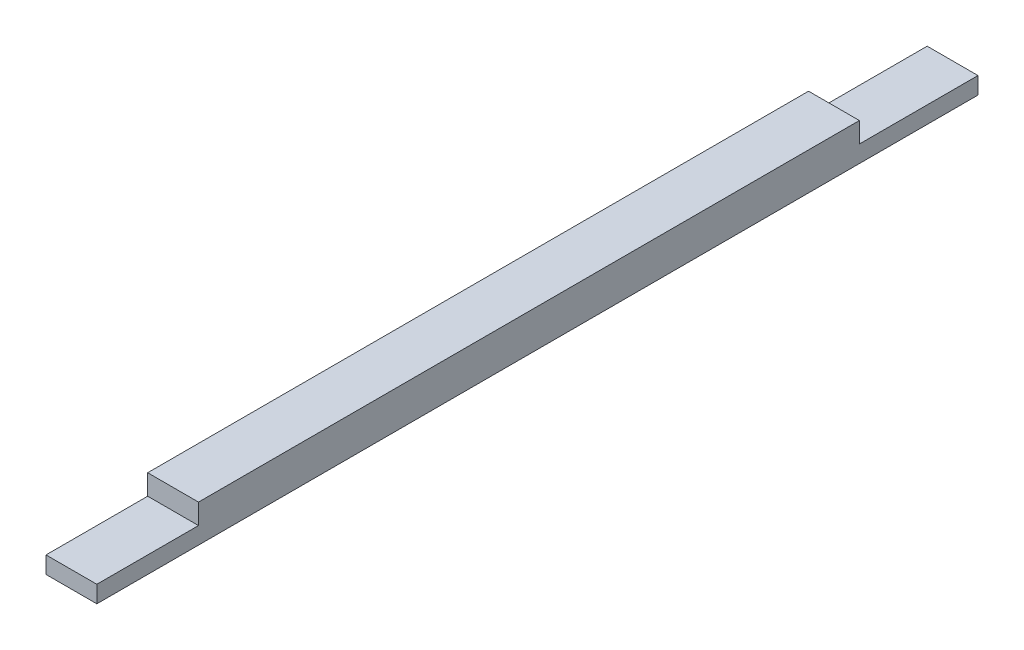
ISO-10303-21;
HEADER;
FILE_DESCRIPTION(('STEP AP214'),'2;1');
FILE_NAME('part.step','',(''),(''),'','','');
FILE_SCHEMA(('AUTOMOTIVE_DESIGN { 1 0 10303 214 1 1 1 1 }'));
ENDSEC;
DATA;
#1=APPLICATION_CONTEXT('core data for automotive mechanical design processes');
#2=APPLICATION_PROTOCOL_DEFINITION('international standard','automotive_design',2000,#1);
#3=PRODUCT_CONTEXT('',#1,'mechanical');
#4=PRODUCT('Part','Part','',(#3));
#5=PRODUCT_RELATED_PRODUCT_CATEGORY('part','',(#4));
#6=PRODUCT_DEFINITION_FORMATION('','',#4);
#7=PRODUCT_DEFINITION_CONTEXT('part definition',#1,'design');
#8=PRODUCT_DEFINITION('design','',#6,#7);
#9=PRODUCT_DEFINITION_SHAPE('','',#8);
#10=(LENGTH_UNIT() NAMED_UNIT(*) SI_UNIT(.MILLI.,.METRE.));
#11=(NAMED_UNIT(*) PLANE_ANGLE_UNIT() SI_UNIT($,.RADIAN.));
#12=(NAMED_UNIT(*) SI_UNIT($,.STERADIAN.) SOLID_ANGLE_UNIT());
#13=UNCERTAINTY_MEASURE_WITH_UNIT(LENGTH_MEASURE(1.E-05),#10,'distance_accuracy_value','');
#14=(GEOMETRIC_REPRESENTATION_CONTEXT(3) GLOBAL_UNCERTAINTY_ASSIGNED_CONTEXT((#13)) GLOBAL_UNIT_ASSIGNED_CONTEXT((#10,
#11,#12)) REPRESENTATION_CONTEXT('',''));
#15=CARTESIAN_POINT('',(0.,0.,0.));
#16=DIRECTION('',(0.,0.,1.));
#17=DIRECTION('',(1.,0.,0.));
#18=AXIS2_PLACEMENT_3D('',#15,#16,#17);
#19=CARTESIAN_POINT('',(0.,0.,52.));
#20=DIRECTION('',(0.,-1.,0.));
#21=DIRECTION('',(0.,0.,-1.));
#22=AXIS2_PLACEMENT_3D('',#19,#20,#21);
#23=PLANE('',#22);
#24=DIRECTION('',(-1.,0.,0.));
#25=VECTOR('',#24,1.);
#26=CARTESIAN_POINT('',(0.,0.,7.));
#27=LINE('',#26,#25);
#28=CARTESIAN_POINT('',(3.,0.,7.00000000000001));
#29=VERTEX_POINT('',#28);
#30=CARTESIAN_POINT('',(0.,0.,7.00000000000001));
#31=VERTEX_POINT('',#30);
#32=EDGE_CURVE('E49',#29,#31,#27,.T.);
#33=ORIENTED_EDGE('',*,*,#32,.F.);
#34=DIRECTION('',(0.,0.,-1.));
#35=VECTOR('',#34,1.);
#36=CARTESIAN_POINT('',(3.,0.,52.));
#37=LINE('',#36,#35);
#38=CARTESIAN_POINT('',(3.,0.,0.));
#39=VERTEX_POINT('',#38);
#40=EDGE_CURVE('E147',#29,#39,#37,.T.);
#41=ORIENTED_EDGE('',*,*,#40,.T.);
#42=DIRECTION('',(-1.,0.,0.));
#43=VECTOR('',#42,1.);
#44=CARTESIAN_POINT('',(0.,0.,0.));
#45=LINE('',#44,#43);
#46=CARTESIAN_POINT('',(0.,0.,0.));
#47=VERTEX_POINT('',#46);
#48=EDGE_CURVE('E135',#39,#47,#45,.T.);
#49=ORIENTED_EDGE('',*,*,#48,.T.);
#50=DIRECTION('',(0.,0.,-1.));
#51=VECTOR('',#50,1.);
#52=CARTESIAN_POINT('',(0.,0.,52.));
#53=LINE('',#52,#51);
#54=EDGE_CURVE('E54',#31,#47,#53,.T.);
#55=ORIENTED_EDGE('',*,*,#54,.F.);
#56=EDGE_LOOP('',(#33,#41,#49,#55));
#57=FACE_BOUND('',#56,.T.);
#58=ADVANCED_FACE('F34',(#57),#23,.F.);
#59=DIRECTION('',(1.,0.,0.));
#60=VECTOR('',#59,1.);
#61=CARTESIAN_POINT('',(0.,0.,46.));
#62=LINE('',#61,#60);
#63=CARTESIAN_POINT('',(0.,0.,46.));
#64=VERTEX_POINT('',#63);
#65=CARTESIAN_POINT('',(3.,0.,46.));
#66=VERTEX_POINT('',#65);
#67=EDGE_CURVE('E169',#64,#66,#62,.T.);
#68=ORIENTED_EDGE('',*,*,#67,.F.);
#69=CARTESIAN_POINT('',(0.,0.,52.));
#70=VERTEX_POINT('',#69);
#71=EDGE_CURVE('E122',#70,#64,#53,.T.);
#72=ORIENTED_EDGE('',*,*,#71,.F.);
#73=DIRECTION('',(-1.,0.,0.));
#74=VECTOR('',#73,1.);
#75=CARTESIAN_POINT('',(0.,0.,52.));
#76=LINE('',#75,#74);
#77=CARTESIAN_POINT('',(3.,0.,52.));
#78=VERTEX_POINT('',#77);
#79=EDGE_CURVE('E139',#78,#70,#76,.T.);
#80=ORIENTED_EDGE('',*,*,#79,.F.);
#81=EDGE_CURVE('E148',#78,#66,#37,.T.);
#82=ORIENTED_EDGE('',*,*,#81,.T.);
#83=EDGE_LOOP('',(#68,#72,#80,#82));
#84=FACE_BOUND('',#83,.T.);
#85=ADVANCED_FACE('F174',(#84),#23,.F.);
#86=CARTESIAN_POINT('',(0.,0.,52.));
#87=DIRECTION('',(1.,0.,0.));
#88=DIRECTION('',(0.,1.,0.));
#89=AXIS2_PLACEMENT_3D('',#86,#87,#88);
#90=PLANE('',#89);
#91=DIRECTION('',(0.,-1.,0.));
#92=VECTOR('',#91,1.);
#93=CARTESIAN_POINT('',(0.,0.,0.));
#94=LINE('',#93,#92);
#95=CARTESIAN_POINT('',(0.,-1.,0.));
#96=VERTEX_POINT('',#95);
#97=EDGE_CURVE('E123',#47,#96,#94,.T.);
#98=ORIENTED_EDGE('',*,*,#97,.T.);
#99=DIRECTION('',(0.,0.,-1.));
#100=VECTOR('',#99,1.);
#101=CARTESIAN_POINT('',(0.,-1.,52.));
#102=LINE('',#101,#100);
#103=CARTESIAN_POINT('',(0.,-1.,52.));
#104=VERTEX_POINT('',#103);
#105=EDGE_CURVE('E11',#104,#96,#102,.T.);
#106=ORIENTED_EDGE('',*,*,#105,.F.);
#107=DIRECTION('',(0.,-1.,0.));
#108=VECTOR('',#107,1.);
#109=CARTESIAN_POINT('',(0.,0.,52.));
#110=LINE('',#109,#108);
#111=EDGE_CURVE('E131',#70,#104,#110,.T.);
#112=ORIENTED_EDGE('',*,*,#111,.F.);
#113=ORIENTED_EDGE('',*,*,#71,.T.);
#114=DIRECTION('',(0.,-1.,0.));
#115=VECTOR('',#114,1.);
#116=CARTESIAN_POINT('',(0.,1.2,46.));
#117=LINE('',#116,#115);
#118=CARTESIAN_POINT('',(0.,1.2,46.));
#119=VERTEX_POINT('',#118);
#120=EDGE_CURVE('E102',#119,#64,#117,.T.);
#121=ORIENTED_EDGE('',*,*,#120,.F.);
#122=DIRECTION('',(0.,0.,1.));
#123=VECTOR('',#122,1.);
#124=CARTESIAN_POINT('',(0.,1.2,7.));
#125=LINE('',#124,#123);
#126=CARTESIAN_POINT('',(0.,1.2,7.));
#127=VERTEX_POINT('',#126);
#128=EDGE_CURVE('E108',#127,#119,#125,.T.);
#129=ORIENTED_EDGE('',*,*,#128,.F.);
#130=DIRECTION('',(0.,-1.,0.));
#131=VECTOR('',#130,1.);
#132=CARTESIAN_POINT('',(0.,1.2,7.));
#133=LINE('',#132,#131);
#134=EDGE_CURVE('E165',#127,#31,#133,.T.);
#135=ORIENTED_EDGE('',*,*,#134,.T.);
#136=ORIENTED_EDGE('',*,*,#54,.T.);
#137=EDGE_LOOP('',(#98,#106,#112,#113,#121,#129,#135,#136));
#138=FACE_BOUND('',#137,.T.);
#139=ADVANCED_FACE('F36',(#138),#90,.F.);
#140=CARTESIAN_POINT('',(0.,-1.,52.));
#141=DIRECTION('',(0.,1.,0.));
#142=DIRECTION('',(0.,0.,1.));
#143=AXIS2_PLACEMENT_3D('',#140,#141,#142);
#144=PLANE('',#143);
#145=DIRECTION('',(1.,0.,0.));
#146=VECTOR('',#145,1.);
#147=CARTESIAN_POINT('',(0.,-1.,0.));
#148=LINE('',#147,#146);
#149=CARTESIAN_POINT('',(3.,-1.,0.));
#150=VERTEX_POINT('',#149);
#151=EDGE_CURVE('E125',#96,#150,#148,.T.);
#152=ORIENTED_EDGE('',*,*,#151,.T.);
#153=DIRECTION('',(0.,0.,-1.));
#154=VECTOR('',#153,1.);
#155=CARTESIAN_POINT('',(3.,-1.,52.));
#156=LINE('',#155,#154);
#157=CARTESIAN_POINT('',(3.,-1.,52.));
#158=VERTEX_POINT('',#157);
#159=EDGE_CURVE('E42',#158,#150,#156,.T.);
#160=ORIENTED_EDGE('',*,*,#159,.F.);
#161=DIRECTION('',(1.,0.,0.));
#162=VECTOR('',#161,1.);
#163=CARTESIAN_POINT('',(0.,-1.,52.));
#164=LINE('',#163,#162);
#165=EDGE_CURVE('E134',#104,#158,#164,.T.);
#166=ORIENTED_EDGE('',*,*,#165,.F.);
#167=ORIENTED_EDGE('',*,*,#105,.T.);
#168=EDGE_LOOP('',(#152,#160,#166,#167));
#169=FACE_BOUND('',#168,.T.);
#170=ADVANCED_FACE('F178',(#169),#144,.F.);
#171=CARTESIAN_POINT('',(3.,0.,52.));
#172=DIRECTION('',(-1.,0.,0.));
#173=DIRECTION('',(0.,0.,1.));
#174=AXIS2_PLACEMENT_3D('',#171,#172,#173);
#175=PLANE('',#174);
#176=DIRECTION('',(0.,1.,0.));
#177=VECTOR('',#176,1.);
#178=CARTESIAN_POINT('',(3.,0.,0.));
#179=LINE('',#178,#177);
#180=EDGE_CURVE('E142',#150,#39,#179,.T.);
#181=ORIENTED_EDGE('',*,*,#180,.T.);
#182=ORIENTED_EDGE('',*,*,#40,.F.);
#183=DIRECTION('',(0.,-1.,0.));
#184=VECTOR('',#183,1.);
#185=CARTESIAN_POINT('',(3.,1.2,7.));
#186=LINE('',#185,#184);
#187=CARTESIAN_POINT('',(3.,1.2,7.));
#188=VERTEX_POINT('',#187);
#189=EDGE_CURVE('E127',#188,#29,#186,.T.);
#190=ORIENTED_EDGE('',*,*,#189,.F.);
#191=DIRECTION('',(0.,0.,-1.));
#192=VECTOR('',#191,1.);
#193=CARTESIAN_POINT('',(3.,1.2,7.));
#194=LINE('',#193,#192);
#195=CARTESIAN_POINT('',(3.,1.2,46.));
#196=VERTEX_POINT('',#195);
#197=EDGE_CURVE('E107',#196,#188,#194,.T.);
#198=ORIENTED_EDGE('',*,*,#197,.F.);
#199=DIRECTION('',(0.,-1.,0.));
#200=VECTOR('',#199,1.);
#201=CARTESIAN_POINT('',(3.,1.2,46.));
#202=LINE('',#201,#200);
#203=EDGE_CURVE('E104',#196,#66,#202,.T.);
#204=ORIENTED_EDGE('',*,*,#203,.T.);
#205=ORIENTED_EDGE('',*,*,#81,.F.);
#206=DIRECTION('',(0.,1.,0.));
#207=VECTOR('',#206,1.);
#208=CARTESIAN_POINT('',(3.,0.,52.));
#209=LINE('',#208,#207);
#210=EDGE_CURVE('E137',#158,#78,#209,.T.);
#211=ORIENTED_EDGE('',*,*,#210,.F.);
#212=ORIENTED_EDGE('',*,*,#159,.T.);
#213=EDGE_LOOP('',(#181,#182,#190,#198,#204,#205,#211,#212));
#214=FACE_BOUND('',#213,.T.);
#215=ADVANCED_FACE('F154',(#214),#175,.F.);
#216=CARTESIAN_POINT('',(0.,0.,52.));
#217=DIRECTION('',(0.,0.,1.));
#218=DIRECTION('',(1.,0.,0.));
#219=AXIS2_PLACEMENT_3D('',#216,#217,#218);
#220=PLANE('',#219);
#221=ORIENTED_EDGE('',*,*,#111,.T.);
#222=ORIENTED_EDGE('',*,*,#165,.T.);
#223=ORIENTED_EDGE('',*,*,#210,.T.);
#224=ORIENTED_EDGE('',*,*,#79,.T.);
#225=EDGE_LOOP('',(#221,#222,#223,#224));
#226=FACE_BOUND('',#225,.T.);
#227=ADVANCED_FACE('F176',(#226),#220,.T.);
#228=CARTESIAN_POINT('',(0.,0.,0.));
#229=DIRECTION('',(0.,0.,1.));
#230=DIRECTION('',(1.,0.,0.));
#231=AXIS2_PLACEMENT_3D('',#228,#229,#230);
#232=PLANE('',#231);
#233=ORIENTED_EDGE('',*,*,#97,.F.);
#234=ORIENTED_EDGE('',*,*,#48,.F.);
#235=ORIENTED_EDGE('',*,*,#180,.F.);
#236=ORIENTED_EDGE('',*,*,#151,.F.);
#237=EDGE_LOOP('',(#233,#234,#235,#236));
#238=FACE_BOUND('',#237,.T.);
#239=ADVANCED_FACE('F160',(#238),#232,.F.);
#240=CARTESIAN_POINT('',(0.,1.2,46.));
#241=DIRECTION('',(0.,0.,-1.));
#242=DIRECTION('',(-1.,0.,0.));
#243=AXIS2_PLACEMENT_3D('',#240,#241,#242);
#244=PLANE('',#243);
#245=ORIENTED_EDGE('',*,*,#67,.T.);
#246=ORIENTED_EDGE('',*,*,#203,.F.);
#247=DIRECTION('',(1.,0.,0.));
#248=VECTOR('',#247,1.);
#249=CARTESIAN_POINT('',(0.,1.2,46.));
#250=LINE('',#249,#248);
#251=EDGE_CURVE('E97',#119,#196,#250,.T.);
#252=ORIENTED_EDGE('',*,*,#251,.F.);
#253=ORIENTED_EDGE('',*,*,#120,.T.);
#254=EDGE_LOOP('',(#245,#246,#252,#253));
#255=FACE_BOUND('',#254,.T.);
#256=ADVANCED_FACE('F100',(#255),#244,.F.);
#257=CARTESIAN_POINT('',(0.,1.2,7.));
#258=DIRECTION('',(0.,0.,1.));
#259=DIRECTION('',(1.,0.,0.));
#260=AXIS2_PLACEMENT_3D('',#257,#258,#259);
#261=PLANE('',#260);
#262=ORIENTED_EDGE('',*,*,#32,.T.);
#263=ORIENTED_EDGE('',*,*,#134,.F.);
#264=DIRECTION('',(-1.,0.,0.));
#265=VECTOR('',#264,1.);
#266=CARTESIAN_POINT('',(0.,1.2,7.));
#267=LINE('',#266,#265);
#268=EDGE_CURVE('E113',#188,#127,#267,.T.);
#269=ORIENTED_EDGE('',*,*,#268,.F.);
#270=ORIENTED_EDGE('',*,*,#189,.T.);
#271=EDGE_LOOP('',(#262,#263,#269,#270));
#272=FACE_BOUND('',#271,.T.);
#273=ADVANCED_FACE('F164',(#272),#261,.F.);
#274=CARTESIAN_POINT('',(0.,1.2,0.));
#275=DIRECTION('',(0.,1.,0.));
#276=DIRECTION('',(0.,0.,1.));
#277=AXIS2_PLACEMENT_3D('',#274,#275,#276);
#278=PLANE('',#277);
#279=ORIENTED_EDGE('',*,*,#128,.T.);
#280=ORIENTED_EDGE('',*,*,#251,.T.);
#281=ORIENTED_EDGE('',*,*,#197,.T.);
#282=ORIENTED_EDGE('',*,*,#268,.T.);
#283=EDGE_LOOP('',(#279,#280,#281,#282));
#284=FACE_BOUND('',#283,.T.);
#285=ADVANCED_FACE('F111',(#284),#278,.T.);
#286=CLOSED_SHELL('',(#58,#85,#139,#170,#215,#227,#239,#256,#273,#285));
#287=MANIFOLD_SOLID_BREP('B2',#286);
#288=ADVANCED_BREP_SHAPE_REPRESENTATION('',(#18,#287),#14);
#289=SHAPE_DEFINITION_REPRESENTATION(#9,#288);
ENDSEC;
END-ISO-10303-21;
